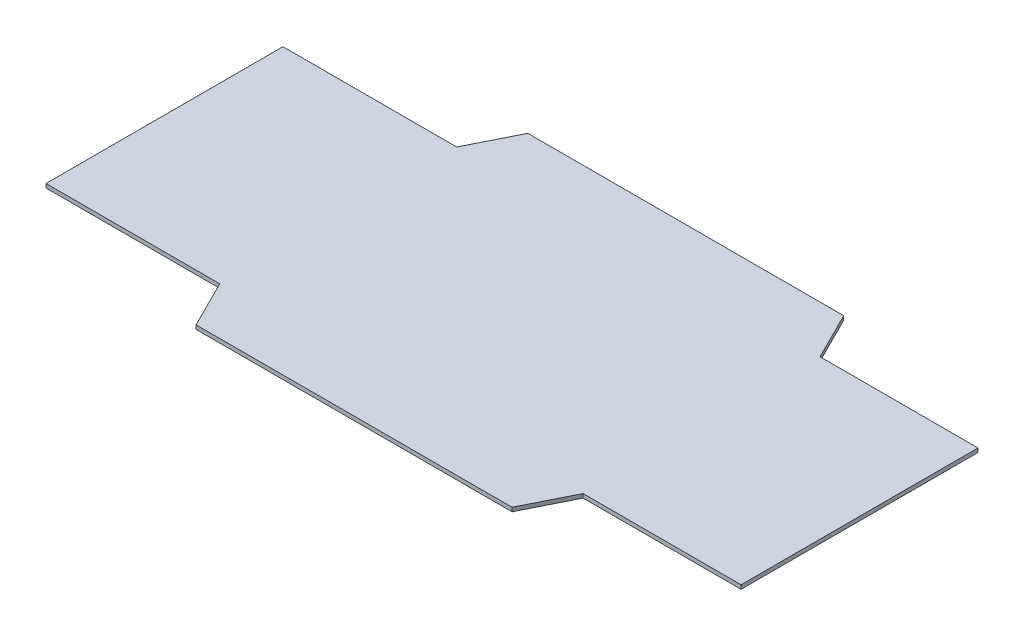
ISO-10303-21;
HEADER;
FILE_DESCRIPTION(('STEP AP214'),'2;1');
FILE_NAME('part.step','',(''),(''),'','','');
FILE_SCHEMA(('AUTOMOTIVE_DESIGN { 1 0 10303 214 1 1 1 1 }'));
ENDSEC;
DATA;
#1=APPLICATION_CONTEXT('core data for automotive mechanical design processes');
#2=APPLICATION_PROTOCOL_DEFINITION('international standard','automotive_design',2000,#1);
#3=PRODUCT_CONTEXT('',#1,'mechanical');
#4=PRODUCT('Part','Part','',(#3));
#5=PRODUCT_RELATED_PRODUCT_CATEGORY('part','',(#4));
#6=PRODUCT_DEFINITION_FORMATION('','',#4);
#7=PRODUCT_DEFINITION_CONTEXT('part definition',#1,'design');
#8=PRODUCT_DEFINITION('design','',#6,#7);
#9=PRODUCT_DEFINITION_SHAPE('','',#8);
#10=(LENGTH_UNIT() NAMED_UNIT(*) SI_UNIT(.MILLI.,.METRE.));
#11=(NAMED_UNIT(*) PLANE_ANGLE_UNIT() SI_UNIT($,.RADIAN.));
#12=(NAMED_UNIT(*) SI_UNIT($,.STERADIAN.) SOLID_ANGLE_UNIT());
#13=UNCERTAINTY_MEASURE_WITH_UNIT(LENGTH_MEASURE(1.E-05),#10,'distance_accuracy_value','');
#14=(GEOMETRIC_REPRESENTATION_CONTEXT(3) GLOBAL_UNCERTAINTY_ASSIGNED_CONTEXT((#13)) GLOBAL_UNIT_ASSIGNED_CONTEXT((#10,
#11,#12)) REPRESENTATION_CONTEXT('',''));
#15=CARTESIAN_POINT('',(0.,0.,0.));
#16=DIRECTION('',(0.,0.,1.));
#17=DIRECTION('',(1.,0.,0.));
#18=AXIS2_PLACEMENT_3D('',#15,#16,#17);
#19=CARTESIAN_POINT('',(279.4,1.5875,-95.25));
#20=DIRECTION('',(-1.,0.,0.));
#21=DIRECTION('',(0.,0.,1.));
#22=AXIS2_PLACEMENT_3D('',#19,#20,#21);
#23=PLANE('',#22);
#24=DIRECTION('',(0.,0.,-1.));
#25=VECTOR('',#24,1.);
#26=CARTESIAN_POINT('',(279.4,-1.5875,-95.25));
#27=LINE('',#26,#25);
#28=CARTESIAN_POINT('',(279.4,-1.5875,95.25));
#29=VERTEX_POINT('',#28);
#30=CARTESIAN_POINT('',(279.4,-1.5875,-95.25));
#31=VERTEX_POINT('',#30);
#32=EDGE_CURVE('E156',#29,#31,#27,.T.);
#33=ORIENTED_EDGE('',*,*,#32,.T.);
#34=DIRECTION('',(0.,-1.,0.));
#35=VECTOR('',#34,1.);
#36=CARTESIAN_POINT('',(279.4,1.5875,-95.25));
#37=LINE('',#36,#35);
#38=CARTESIAN_POINT('',(279.4,1.5875,-95.25));
#39=VERTEX_POINT('',#38);
#40=EDGE_CURVE('E11',#39,#31,#37,.T.);
#41=ORIENTED_EDGE('',*,*,#40,.F.);
#42=DIRECTION('',(0.,0.,-1.));
#43=VECTOR('',#42,1.);
#44=CARTESIAN_POINT('',(279.4,1.5875,-95.25));
#45=LINE('',#44,#43);
#46=CARTESIAN_POINT('',(279.4,1.5875,95.25));
#47=VERTEX_POINT('',#46);
#48=EDGE_CURVE('E178',#47,#39,#45,.T.);
#49=ORIENTED_EDGE('',*,*,#48,.F.);
#50=DIRECTION('',(0.,-1.,0.));
#51=VECTOR('',#50,1.);
#52=CARTESIAN_POINT('',(279.4,1.5875,95.25));
#53=LINE('',#52,#51);
#54=EDGE_CURVE('E152',#47,#29,#53,.T.);
#55=ORIENTED_EDGE('',*,*,#54,.T.);
#56=EDGE_LOOP('',(#33,#41,#49,#55));
#57=FACE_BOUND('',#56,.T.);
#58=ADVANCED_FACE('F36',(#57),#23,.F.);
#59=CARTESIAN_POINT('',(152.4,1.5875,-95.25));
#60=DIRECTION('',(0.,0.,1.));
#61=DIRECTION('',(1.,0.,0.));
#62=AXIS2_PLACEMENT_3D('',#59,#60,#61);
#63=PLANE('',#62);
#64=DIRECTION('',(-1.,0.,0.));
#65=VECTOR('',#64,1.);
#66=CARTESIAN_POINT('',(152.4,-1.5875,-95.25));
#67=LINE('',#66,#65);
#68=CARTESIAN_POINT('',(152.4,-1.5875,-95.25));
#69=VERTEX_POINT('',#68);
#70=EDGE_CURVE('E159',#31,#69,#67,.T.);
#71=ORIENTED_EDGE('',*,*,#70,.T.);
#72=DIRECTION('',(0.,-1.,0.));
#73=VECTOR('',#72,1.);
#74=CARTESIAN_POINT('',(152.4,1.5875,-95.25));
#75=LINE('',#74,#73);
#76=CARTESIAN_POINT('',(152.4,1.5875,-95.25));
#77=VERTEX_POINT('',#76);
#78=EDGE_CURVE('E44',#77,#69,#75,.T.);
#79=ORIENTED_EDGE('',*,*,#78,.F.);
#80=DIRECTION('',(-1.,0.,0.));
#81=VECTOR('',#80,1.);
#82=CARTESIAN_POINT('',(152.4,1.5875,-95.25));
#83=LINE('',#82,#81);
#84=EDGE_CURVE('E107',#39,#77,#83,.T.);
#85=ORIENTED_EDGE('',*,*,#84,.F.);
#86=ORIENTED_EDGE('',*,*,#40,.T.);
#87=EDGE_LOOP('',(#71,#79,#85,#86));
#88=FACE_BOUND('',#87,.T.);
#89=ADVANCED_FACE('F256',(#88),#63,.F.);
#90=CARTESIAN_POINT('',(133.35,1.5875,-133.35));
#91=DIRECTION('',(-0.894427190999916,0.,0.447213595499958));
#92=DIRECTION('',(0.447213595499958,0.,0.894427190999916));
#93=AXIS2_PLACEMENT_3D('',#90,#91,#92);
#94=PLANE('',#93);
#95=DIRECTION('',(-0.447213595499958,0.,-0.894427190999916));
#96=VECTOR('',#95,1.);
#97=CARTESIAN_POINT('',(133.35,-1.5875,-133.35));
#98=LINE('',#97,#96);
#99=CARTESIAN_POINT('',(133.35,-1.5875,-133.35));
#100=VERTEX_POINT('',#99);
#101=EDGE_CURVE('E161',#69,#100,#98,.T.);
#102=ORIENTED_EDGE('',*,*,#101,.T.);
#103=DIRECTION('',(0.,-1.,0.));
#104=VECTOR('',#103,1.);
#105=CARTESIAN_POINT('',(133.35,1.5875,-133.35));
#106=LINE('',#105,#104);
#107=CARTESIAN_POINT('',(133.35,1.5875,-133.35));
#108=VERTEX_POINT('',#107);
#109=EDGE_CURVE('E197',#108,#100,#106,.T.);
#110=ORIENTED_EDGE('',*,*,#109,.F.);
#111=DIRECTION('',(-0.447213595499958,0.,-0.894427190999916));
#112=VECTOR('',#111,1.);
#113=CARTESIAN_POINT('',(133.35,1.5875,-133.35));
#114=LINE('',#113,#112);
#115=EDGE_CURVE('E205',#77,#108,#114,.T.);
#116=ORIENTED_EDGE('',*,*,#115,.F.);
#117=ORIENTED_EDGE('',*,*,#78,.T.);
#118=EDGE_LOOP('',(#102,#110,#116,#117));
#119=FACE_BOUND('',#118,.T.);
#120=ADVANCED_FACE('F203',(#119),#94,.F.);
#121=CARTESIAN_POINT('',(-120.65,1.5875,-133.35));
#122=DIRECTION('',(0.,0.,1.));
#123=DIRECTION('',(1.,0.,0.));
#124=AXIS2_PLACEMENT_3D('',#121,#122,#123);
#125=PLANE('',#124);
#126=DIRECTION('',(-1.,0.,0.));
#127=VECTOR('',#126,1.);
#128=CARTESIAN_POINT('',(-120.65,-1.5875,-133.35));
#129=LINE('',#128,#127);
#130=CARTESIAN_POINT('',(-120.65,-1.5875,-133.35));
#131=VERTEX_POINT('',#130);
#132=EDGE_CURVE('E163',#100,#131,#129,.T.);
#133=ORIENTED_EDGE('',*,*,#132,.T.);
#134=DIRECTION('',(0.,-1.,0.));
#135=VECTOR('',#134,1.);
#136=CARTESIAN_POINT('',(-120.65,1.5875,-133.35));
#137=LINE('',#136,#135);
#138=CARTESIAN_POINT('',(-120.65,1.5875,-133.35));
#139=VERTEX_POINT('',#138);
#140=EDGE_CURVE('E194',#139,#131,#137,.T.);
#141=ORIENTED_EDGE('',*,*,#140,.F.);
#142=DIRECTION('',(-1.,0.,0.));
#143=VECTOR('',#142,1.);
#144=CARTESIAN_POINT('',(-120.65,1.5875,-133.35));
#145=LINE('',#144,#143);
#146=EDGE_CURVE('E223',#108,#139,#145,.T.);
#147=ORIENTED_EDGE('',*,*,#146,.F.);
#148=ORIENTED_EDGE('',*,*,#109,.T.);
#149=EDGE_LOOP('',(#133,#141,#147,#148));
#150=FACE_BOUND('',#149,.T.);
#151=ADVANCED_FACE('F214',(#150),#125,.F.);
#152=CARTESIAN_POINT('',(-139.7,1.5875,-95.25));
#153=DIRECTION('',(0.894427190999916,0.,0.447213595499958));
#154=DIRECTION('',(0.447213595499958,0.,-0.894427190999916));
#155=AXIS2_PLACEMENT_3D('',#152,#153,#154);
#156=PLANE('',#155);
#157=DIRECTION('',(-0.447213595499958,0.,0.894427190999916));
#158=VECTOR('',#157,1.);
#159=CARTESIAN_POINT('',(-139.7,-1.5875,-95.25));
#160=LINE('',#159,#158);
#161=CARTESIAN_POINT('',(-139.7,-1.5875,-95.25));
#162=VERTEX_POINT('',#161);
#163=EDGE_CURVE('E165',#131,#162,#160,.T.);
#164=ORIENTED_EDGE('',*,*,#163,.T.);
#165=DIRECTION('',(0.,-1.,0.));
#166=VECTOR('',#165,1.);
#167=CARTESIAN_POINT('',(-139.7,1.5875,-95.25));
#168=LINE('',#167,#166);
#169=CARTESIAN_POINT('',(-139.7,1.5875,-95.25));
#170=VERTEX_POINT('',#169);
#171=EDGE_CURVE('E191',#170,#162,#168,.T.);
#172=ORIENTED_EDGE('',*,*,#171,.F.);
#173=DIRECTION('',(-0.447213595499958,0.,0.894427190999916));
#174=VECTOR('',#173,1.);
#175=CARTESIAN_POINT('',(-139.7,1.5875,-95.25));
#176=LINE('',#175,#174);
#177=EDGE_CURVE('E220',#139,#170,#176,.T.);
#178=ORIENTED_EDGE('',*,*,#177,.F.);
#179=ORIENTED_EDGE('',*,*,#140,.T.);
#180=EDGE_LOOP('',(#164,#172,#178,#179));
#181=FACE_BOUND('',#180,.T.);
#182=ADVANCED_FACE('F218',(#181),#156,.F.);
#183=CARTESIAN_POINT('',(-279.4,1.5875,-95.25));
#184=DIRECTION('',(0.,0.,1.));
#185=DIRECTION('',(1.,0.,0.));
#186=AXIS2_PLACEMENT_3D('',#183,#184,#185);
#187=PLANE('',#186);
#188=DIRECTION('',(-1.,0.,0.));
#189=VECTOR('',#188,1.);
#190=CARTESIAN_POINT('',(-279.4,-1.5875,-95.25));
#191=LINE('',#190,#189);
#192=CARTESIAN_POINT('',(-279.4,-1.5875,-95.25));
#193=VERTEX_POINT('',#192);
#194=EDGE_CURVE('E167',#162,#193,#191,.T.);
#195=ORIENTED_EDGE('',*,*,#194,.T.);
#196=DIRECTION('',(0.,-1.,0.));
#197=VECTOR('',#196,1.);
#198=CARTESIAN_POINT('',(-279.4,1.5875,-95.25));
#199=LINE('',#198,#197);
#200=CARTESIAN_POINT('',(-279.4,1.5875,-95.25));
#201=VERTEX_POINT('',#200);
#202=EDGE_CURVE('E188',#201,#193,#199,.T.);
#203=ORIENTED_EDGE('',*,*,#202,.F.);
#204=DIRECTION('',(-1.,0.,0.));
#205=VECTOR('',#204,1.);
#206=CARTESIAN_POINT('',(-279.4,1.5875,-95.25));
#207=LINE('',#206,#205);
#208=EDGE_CURVE('E222',#170,#201,#207,.T.);
#209=ORIENTED_EDGE('',*,*,#208,.F.);
#210=ORIENTED_EDGE('',*,*,#171,.T.);
#211=EDGE_LOOP('',(#195,#203,#209,#210));
#212=FACE_BOUND('',#211,.T.);
#213=ADVANCED_FACE('F269',(#212),#187,.F.);
#214=CARTESIAN_POINT('',(-279.4,1.5875,-95.25));
#215=DIRECTION('',(1.,0.,0.));
#216=DIRECTION('',(0.,0.,-1.));
#217=AXIS2_PLACEMENT_3D('',#214,#215,#216);
#218=PLANE('',#217);
#219=DIRECTION('',(0.,0.,1.));
#220=VECTOR('',#219,1.);
#221=CARTESIAN_POINT('',(-279.4,-1.5875,-95.25));
#222=LINE('',#221,#220);
#223=CARTESIAN_POINT('',(-279.4,-1.5875,95.25));
#224=VERTEX_POINT('',#223);
#225=EDGE_CURVE('E169',#193,#224,#222,.T.);
#226=ORIENTED_EDGE('',*,*,#225,.T.);
#227=DIRECTION('',(0.,-1.,0.));
#228=VECTOR('',#227,1.);
#229=CARTESIAN_POINT('',(-279.4,1.5875,95.25));
#230=LINE('',#229,#228);
#231=CARTESIAN_POINT('',(-279.4,1.5875,95.25));
#232=VERTEX_POINT('',#231);
#233=EDGE_CURVE('E185',#232,#224,#230,.T.);
#234=ORIENTED_EDGE('',*,*,#233,.F.);
#235=DIRECTION('',(0.,0.,1.));
#236=VECTOR('',#235,1.);
#237=CARTESIAN_POINT('',(-279.4,1.5875,-95.25));
#238=LINE('',#237,#236);
#239=EDGE_CURVE('E225',#201,#232,#238,.T.);
#240=ORIENTED_EDGE('',*,*,#239,.F.);
#241=ORIENTED_EDGE('',*,*,#202,.T.);
#242=EDGE_LOOP('',(#226,#234,#240,#241));
#243=FACE_BOUND('',#242,.T.);
#244=ADVANCED_FACE('F272',(#243),#218,.F.);
#245=CARTESIAN_POINT('',(-279.4,1.5875,95.25));
#246=DIRECTION('',(0.,0.,-1.));
#247=DIRECTION('',(-1.,0.,0.));
#248=AXIS2_PLACEMENT_3D('',#245,#246,#247);
#249=PLANE('',#248);
#250=DIRECTION('',(1.,0.,0.));
#251=VECTOR('',#250,1.);
#252=CARTESIAN_POINT('',(-279.4,-1.5875,95.25));
#253=LINE('',#252,#251);
#254=CARTESIAN_POINT('',(-139.7,-1.5875,95.25));
#255=VERTEX_POINT('',#254);
#256=EDGE_CURVE('E171',#224,#255,#253,.T.);
#257=ORIENTED_EDGE('',*,*,#256,.T.);
#258=DIRECTION('',(0.,-1.,0.));
#259=VECTOR('',#258,1.);
#260=CARTESIAN_POINT('',(-139.7,1.5875,95.25));
#261=LINE('',#260,#259);
#262=CARTESIAN_POINT('',(-139.7,1.5875,95.25));
#263=VERTEX_POINT('',#262);
#264=EDGE_CURVE('E182',#263,#255,#261,.T.);
#265=ORIENTED_EDGE('',*,*,#264,.F.);
#266=DIRECTION('',(1.,0.,0.));
#267=VECTOR('',#266,1.);
#268=CARTESIAN_POINT('',(-279.4,1.5875,95.25));
#269=LINE('',#268,#267);
#270=EDGE_CURVE('E231',#232,#263,#269,.T.);
#271=ORIENTED_EDGE('',*,*,#270,.F.);
#272=ORIENTED_EDGE('',*,*,#233,.T.);
#273=EDGE_LOOP('',(#257,#265,#271,#272));
#274=FACE_BOUND('',#273,.T.);
#275=ADVANCED_FACE('F237',(#274),#249,.F.);
#276=CARTESIAN_POINT('',(-139.7,1.5875,95.25));
#277=DIRECTION('',(0.894427190999916,0.,-0.447213595499958));
#278=DIRECTION('',(-0.447213595499958,0.,-0.894427190999916));
#279=AXIS2_PLACEMENT_3D('',#276,#277,#278);
#280=PLANE('',#279);
#281=DIRECTION('',(0.447213595499958,0.,0.894427190999916));
#282=VECTOR('',#281,1.);
#283=CARTESIAN_POINT('',(-139.7,-1.5875,95.25));
#284=LINE('',#283,#282);
#285=CARTESIAN_POINT('',(-120.65,-1.5875,133.35));
#286=VERTEX_POINT('',#285);
#287=EDGE_CURVE('E173',#255,#286,#284,.T.);
#288=ORIENTED_EDGE('',*,*,#287,.T.);
#289=DIRECTION('',(0.,-1.,0.));
#290=VECTOR('',#289,1.);
#291=CARTESIAN_POINT('',(-120.65,1.5875,133.35));
#292=LINE('',#291,#290);
#293=CARTESIAN_POINT('',(-120.65,1.5875,133.35));
#294=VERTEX_POINT('',#293);
#295=EDGE_CURVE('E147',#294,#286,#292,.T.);
#296=ORIENTED_EDGE('',*,*,#295,.F.);
#297=DIRECTION('',(0.447213595499958,0.,0.894427190999916));
#298=VECTOR('',#297,1.);
#299=CARTESIAN_POINT('',(-139.7,1.5875,95.25));
#300=LINE('',#299,#298);
#301=EDGE_CURVE('E138',#263,#294,#300,.T.);
#302=ORIENTED_EDGE('',*,*,#301,.F.);
#303=ORIENTED_EDGE('',*,*,#264,.T.);
#304=EDGE_LOOP('',(#288,#296,#302,#303));
#305=FACE_BOUND('',#304,.T.);
#306=ADVANCED_FACE('F241',(#305),#280,.F.);
#307=CARTESIAN_POINT('',(-120.65,1.5875,133.35));
#308=DIRECTION('',(0.,0.,-1.));
#309=DIRECTION('',(-1.,0.,0.));
#310=AXIS2_PLACEMENT_3D('',#307,#308,#309);
#311=PLANE('',#310);
#312=DIRECTION('',(1.,0.,0.));
#313=VECTOR('',#312,1.);
#314=CARTESIAN_POINT('',(-120.65,-1.5875,133.35));
#315=LINE('',#314,#313);
#316=CARTESIAN_POINT('',(133.35,-1.5875,133.35));
#317=VERTEX_POINT('',#316);
#318=EDGE_CURVE('E146',#286,#317,#315,.T.);
#319=ORIENTED_EDGE('',*,*,#318,.T.);
#320=DIRECTION('',(0.,-1.,0.));
#321=VECTOR('',#320,1.);
#322=CARTESIAN_POINT('',(133.35,1.5875,133.35));
#323=LINE('',#322,#321);
#324=CARTESIAN_POINT('',(133.35,1.5875,133.35));
#325=VERTEX_POINT('',#324);
#326=EDGE_CURVE('E143',#325,#317,#323,.T.);
#327=ORIENTED_EDGE('',*,*,#326,.F.);
#328=DIRECTION('',(1.,0.,0.));
#329=VECTOR('',#328,1.);
#330=CARTESIAN_POINT('',(-120.65,1.5875,133.35));
#331=LINE('',#330,#329);
#332=EDGE_CURVE('E132',#294,#325,#331,.T.);
#333=ORIENTED_EDGE('',*,*,#332,.F.);
#334=ORIENTED_EDGE('',*,*,#295,.T.);
#335=EDGE_LOOP('',(#319,#327,#333,#334));
#336=FACE_BOUND('',#335,.T.);
#337=ADVANCED_FACE('F144',(#336),#311,.F.);
#338=CARTESIAN_POINT('',(133.35,1.5875,133.35));
#339=DIRECTION('',(-0.894427190999916,0.,-0.447213595499958));
#340=DIRECTION('',(-0.447213595499958,0.,0.894427190999916));
#341=AXIS2_PLACEMENT_3D('',#338,#339,#340);
#342=PLANE('',#341);
#343=DIRECTION('',(0.447213595499958,0.,-0.894427190999916));
#344=VECTOR('',#343,1.);
#345=CARTESIAN_POINT('',(133.35,-1.5875,133.35));
#346=LINE('',#345,#344);
#347=CARTESIAN_POINT('',(152.4,-1.5875,95.25));
#348=VERTEX_POINT('',#347);
#349=EDGE_CURVE('E93',#317,#348,#346,.T.);
#350=ORIENTED_EDGE('',*,*,#349,.T.);
#351=DIRECTION('',(0.,-1.,0.));
#352=VECTOR('',#351,1.);
#353=CARTESIAN_POINT('',(152.4,1.5875,95.25));
#354=LINE('',#353,#352);
#355=CARTESIAN_POINT('',(152.4,1.5875,95.25));
#356=VERTEX_POINT('',#355);
#357=EDGE_CURVE('E148',#356,#348,#354,.T.);
#358=ORIENTED_EDGE('',*,*,#357,.F.);
#359=DIRECTION('',(0.447213595499958,0.,-0.894427190999916));
#360=VECTOR('',#359,1.);
#361=CARTESIAN_POINT('',(133.35,1.5875,133.35));
#362=LINE('',#361,#360);
#363=EDGE_CURVE('E136',#325,#356,#362,.T.);
#364=ORIENTED_EDGE('',*,*,#363,.F.);
#365=ORIENTED_EDGE('',*,*,#326,.T.);
#366=EDGE_LOOP('',(#350,#358,#364,#365));
#367=FACE_BOUND('',#366,.T.);
#368=ADVANCED_FACE('F150',(#367),#342,.F.);
#369=CARTESIAN_POINT('',(152.4,1.5875,95.25));
#370=DIRECTION('',(0.,0.,-1.));
#371=DIRECTION('',(-1.,0.,0.));
#372=AXIS2_PLACEMENT_3D('',#369,#370,#371);
#373=PLANE('',#372);
#374=DIRECTION('',(1.,0.,0.));
#375=VECTOR('',#374,1.);
#376=CARTESIAN_POINT('',(152.4,-1.5875,95.25));
#377=LINE('',#376,#375);
#378=EDGE_CURVE('E99',#348,#29,#377,.T.);
#379=ORIENTED_EDGE('',*,*,#378,.T.);
#380=ORIENTED_EDGE('',*,*,#54,.F.);
#381=DIRECTION('',(1.,0.,0.));
#382=VECTOR('',#381,1.);
#383=CARTESIAN_POINT('',(152.4,1.5875,95.25));
#384=LINE('',#383,#382);
#385=EDGE_CURVE('E52',#356,#47,#384,.T.);
#386=ORIENTED_EDGE('',*,*,#385,.F.);
#387=ORIENTED_EDGE('',*,*,#357,.T.);
#388=EDGE_LOOP('',(#379,#380,#386,#387));
#389=FACE_BOUND('',#388,.T.);
#390=ADVANCED_FACE('F245',(#389),#373,.F.);
#391=CARTESIAN_POINT('',(0.,1.5875,0.));
#392=DIRECTION('',(0.,1.,0.));
#393=DIRECTION('',(0.,0.,1.));
#394=AXIS2_PLACEMENT_3D('',#391,#392,#393);
#395=PLANE('',#394);
#396=ORIENTED_EDGE('',*,*,#48,.T.);
#397=ORIENTED_EDGE('',*,*,#84,.T.);
#398=ORIENTED_EDGE('',*,*,#115,.T.);
#399=ORIENTED_EDGE('',*,*,#146,.T.);
#400=ORIENTED_EDGE('',*,*,#177,.T.);
#401=ORIENTED_EDGE('',*,*,#208,.T.);
#402=ORIENTED_EDGE('',*,*,#239,.T.);
#403=ORIENTED_EDGE('',*,*,#270,.T.);
#404=ORIENTED_EDGE('',*,*,#301,.T.);
#405=ORIENTED_EDGE('',*,*,#332,.T.);
#406=ORIENTED_EDGE('',*,*,#363,.T.);
#407=ORIENTED_EDGE('',*,*,#385,.T.);
#408=EDGE_LOOP('',(#396,#397,#398,#399,#400,#401,#402,#403,#404,#405,#406,#407));
#409=FACE_BOUND('',#408,.T.);
#410=ADVANCED_FACE('F134',(#409),#395,.T.);
#411=CARTESIAN_POINT('',(0.,-1.5875,0.));
#412=DIRECTION('',(0.,1.,0.));
#413=DIRECTION('',(0.,0.,1.));
#414=AXIS2_PLACEMENT_3D('',#411,#412,#413);
#415=PLANE('',#414);
#416=ORIENTED_EDGE('',*,*,#32,.F.);
#417=ORIENTED_EDGE('',*,*,#378,.F.);
#418=ORIENTED_EDGE('',*,*,#349,.F.);
#419=ORIENTED_EDGE('',*,*,#318,.F.);
#420=ORIENTED_EDGE('',*,*,#287,.F.);
#421=ORIENTED_EDGE('',*,*,#256,.F.);
#422=ORIENTED_EDGE('',*,*,#225,.F.);
#423=ORIENTED_EDGE('',*,*,#194,.F.);
#424=ORIENTED_EDGE('',*,*,#163,.F.);
#425=ORIENTED_EDGE('',*,*,#132,.F.);
#426=ORIENTED_EDGE('',*,*,#101,.F.);
#427=ORIENTED_EDGE('',*,*,#70,.F.);
#428=EDGE_LOOP('',(#416,#417,#418,#419,#420,#421,#422,#423,#424,#425,#426,#427));
#429=FACE_BOUND('',#428,.T.);
#430=ADVANCED_FACE('F209',(#429),#415,.F.);
#431=CLOSED_SHELL('',(#58,#89,#120,#151,#182,#213,#244,#275,#306,#337,#368,#390,#410,#430));
#432=MANIFOLD_SOLID_BREP('B2',#431);
#433=ADVANCED_BREP_SHAPE_REPRESENTATION('',(#18,#432),#14);
#434=SHAPE_DEFINITION_REPRESENTATION(#9,#433);
ENDSEC;
END-ISO-10303-21;
